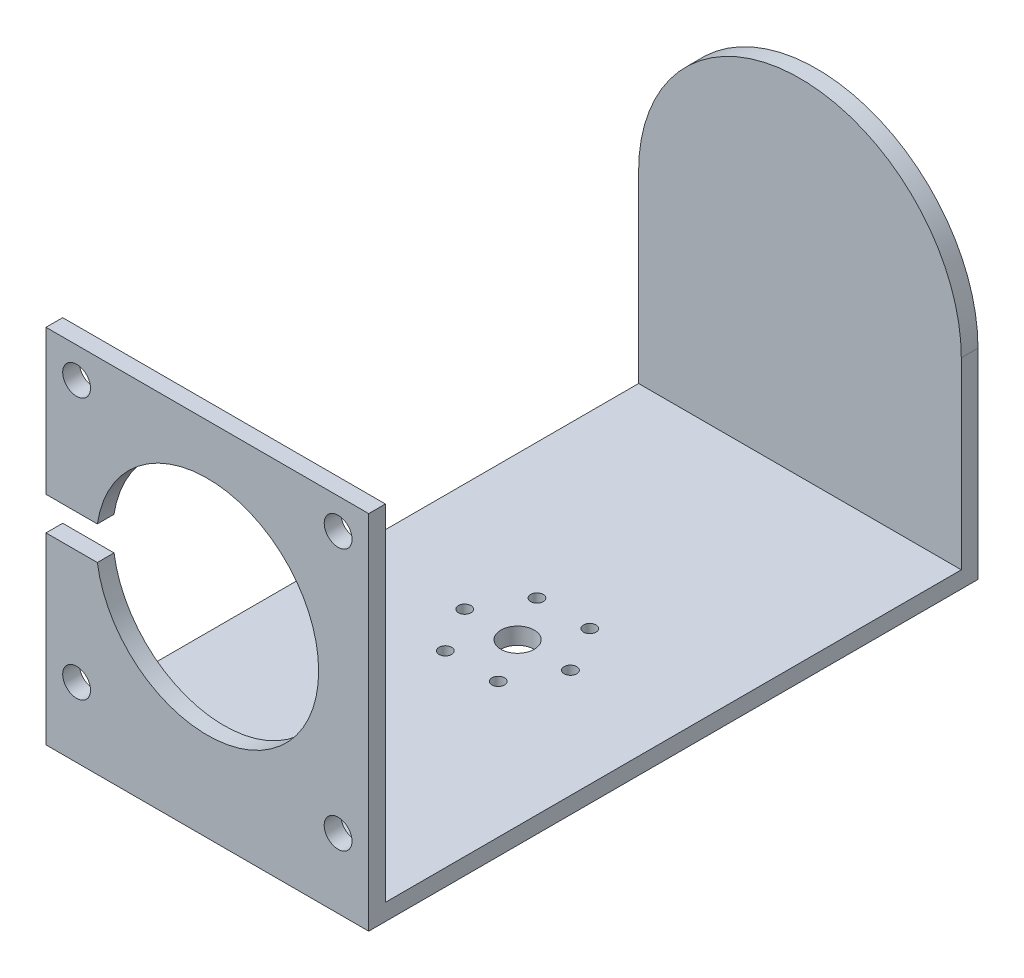
ISO-10303-21;
HEADER;
FILE_DESCRIPTION(('STEP AP214'),'2;1');
FILE_NAME('part.step','',(''),(''),'','','');
FILE_SCHEMA(('AUTOMOTIVE_DESIGN { 1 0 10303 214 1 1 1 1 }'));
ENDSEC;
DATA;
#1=APPLICATION_CONTEXT('core data for automotive mechanical design processes');
#2=APPLICATION_PROTOCOL_DEFINITION('international standard','automotive_design',2000,#1);
#3=PRODUCT_CONTEXT('',#1,'mechanical');
#4=PRODUCT('Part','Part','',(#3));
#5=PRODUCT_RELATED_PRODUCT_CATEGORY('part','',(#4));
#6=PRODUCT_DEFINITION_FORMATION('','',#4);
#7=PRODUCT_DEFINITION_CONTEXT('part definition',#1,'design');
#8=PRODUCT_DEFINITION('design','',#6,#7);
#9=PRODUCT_DEFINITION_SHAPE('','',#8);
#10=(LENGTH_UNIT() NAMED_UNIT(*) SI_UNIT(.MILLI.,.METRE.));
#11=(NAMED_UNIT(*) PLANE_ANGLE_UNIT() SI_UNIT($,.RADIAN.));
#12=(NAMED_UNIT(*) SI_UNIT($,.STERADIAN.) SOLID_ANGLE_UNIT());
#13=UNCERTAINTY_MEASURE_WITH_UNIT(LENGTH_MEASURE(1.E-05),#10,'distance_accuracy_value','');
#14=(GEOMETRIC_REPRESENTATION_CONTEXT(3) GLOBAL_UNCERTAINTY_ASSIGNED_CONTEXT((#13)) GLOBAL_UNIT_ASSIGNED_CONTEXT((#10,
#11,#12)) REPRESENTATION_CONTEXT('',''));
#15=CARTESIAN_POINT('',(0.,0.,0.));
#16=DIRECTION('',(0.,0.,1.));
#17=DIRECTION('',(1.,0.,0.));
#18=AXIS2_PLACEMENT_3D('',#15,#16,#17);
#19=CARTESIAN_POINT('',(0.,0.,0.));
#20=DIRECTION('',(-1.,0.,0.));
#21=DIRECTION('',(0.,0.,1.));
#22=AXIS2_PLACEMENT_3D('',#19,#20,#21);
#23=PLANE('',#22);
#24=DIRECTION('',(0.,0.,1.));
#25=VECTOR('',#24,1.);
#26=CARTESIAN_POINT('',(0.,-31.5991903846266,0.));
#27=LINE('',#26,#25);
#28=CARTESIAN_POINT('',(0.,-31.5991903846266,-30.1483281173427));
#29=VERTEX_POINT('',#28);
#30=CARTESIAN_POINT('',(0.,-31.5991903846266,73.3516718826573));
#31=VERTEX_POINT('',#30);
#32=EDGE_CURVE('E150',#29,#31,#27,.T.);
#33=ORIENTED_EDGE('',*,*,#32,.F.);
#34=DIRECTION('',(0.,-1.,0.));
#35=VECTOR('',#34,1.);
#36=CARTESIAN_POINT('',(0.,-29.5991903846266,-30.1483281173427));
#37=LINE('',#36,#35);
#38=CARTESIAN_POINT('',(0.,1.40080961537345,-30.1483281173427));
#39=VERTEX_POINT('',#38);
#40=EDGE_CURVE('E262',#39,#29,#37,.T.);
#41=ORIENTED_EDGE('',*,*,#40,.F.);
#42=DIRECTION('',(0.,0.,-1.));
#43=VECTOR('',#42,1.);
#44=CARTESIAN_POINT('',(0.,1.40080961537345,24.8516718826573));
#45=LINE('',#44,#43);
#46=CARTESIAN_POINT('',(0.,1.40080961537345,-33.1483281173427));
#47=VERTEX_POINT('',#46);
#48=EDGE_CURVE('E288',#47,#39,#45,.F.);
#49=ORIENTED_EDGE('',*,*,#48,.F.);
#50=DIRECTION('',(0.,1.,0.));
#51=VECTOR('',#50,1.);
#52=CARTESIAN_POINT('',(0.,30.4008096153734,-33.1483281173427));
#53=LINE('',#52,#51);
#54=CARTESIAN_POINT('',(0.,-34.5991903846266,-33.1483281173427));
#55=VERTEX_POINT('',#54);
#56=EDGE_CURVE('E259',#55,#47,#53,.T.);
#57=ORIENTED_EDGE('',*,*,#56,.F.);
#58=DIRECTION('',(0.,0.,-1.));
#59=VECTOR('',#58,1.);
#60=CARTESIAN_POINT('',(0.,-34.5991903846266,-33.1483281173427));
#61=LINE('',#60,#59);
#62=CARTESIAN_POINT('',(0.,-34.5991903846266,76.3516718826573));
#63=VERTEX_POINT('',#62);
#64=EDGE_CURVE('E257',#63,#55,#61,.T.);
#65=ORIENTED_EDGE('',*,*,#64,.F.);
#66=DIRECTION('',(0.,-1.,0.));
#67=VECTOR('',#66,1.);
#68=CARTESIAN_POINT('',(0.,-34.5991903846266,76.3516718826573));
#69=LINE('',#68,#67);
#70=CARTESIAN_POINT('',(0.,-1.59919038462657,76.3516718826573));
#71=VERTEX_POINT('',#70);
#72=EDGE_CURVE('E253',#71,#63,#69,.T.);
#73=ORIENTED_EDGE('',*,*,#72,.F.);
#74=DIRECTION('',(0.,0.,1.));
#75=VECTOR('',#74,1.);
#76=CARTESIAN_POINT('',(0.,-1.59919038462657,66.3516718826573));
#77=LINE('',#76,#75);
#78=CARTESIAN_POINT('',(0.,-1.59919038462657,73.3516718826573));
#79=VERTEX_POINT('',#78);
#80=EDGE_CURVE('E204',#79,#71,#77,.T.);
#81=ORIENTED_EDGE('',*,*,#80,.F.);
#82=DIRECTION('',(0.,1.,0.));
#83=VECTOR('',#82,1.);
#84=CARTESIAN_POINT('',(0.,30.4008096153734,73.3516718826573));
#85=LINE('',#84,#83);
#86=EDGE_CURVE('E242',#31,#79,#85,.T.);
#87=ORIENTED_EDGE('',*,*,#86,.F.);
#88=EDGE_LOOP('',(#33,#41,#49,#57,#65,#73,#81,#87));
#89=FACE_BOUND('',#88,.T.);
#90=ADVANCED_FACE('F39',(#89),#23,.T.);
#91=CARTESIAN_POINT('',(58.,30.4008096153734,-33.1483281173427));
#92=DIRECTION('',(0.,0.,1.));
#93=DIRECTION('',(0.,-1.,0.));
#94=AXIS2_PLACEMENT_3D('',#91,#92,#93);
#95=PLANE('',#94);
#96=ORIENTED_EDGE('',*,*,#56,.T.);
#97=CARTESIAN_POINT('',(29.,1.40080961537345,-33.1483281173427));
#98=DIRECTION('',(0.,0.,1.));
#99=DIRECTION('',(1.,0.,0.));
#100=AXIS2_PLACEMENT_3D('',#97,#98,#99);
#101=CIRCLE('',#100,29.);
#102=CARTESIAN_POINT('',(58.,1.40080961537345,-33.1483281173427));
#103=VERTEX_POINT('',#102);
#104=EDGE_CURVE('E215',#103,#47,#101,.T.);
#105=ORIENTED_EDGE('',*,*,#104,.F.);
#106=DIRECTION('',(0.,1.,0.));
#107=VECTOR('',#106,1.);
#108=CARTESIAN_POINT('',(58.,30.4008096153734,-33.1483281173427));
#109=LINE('',#108,#107);
#110=CARTESIAN_POINT('',(58.,-34.5991903846266,-33.1483281173427));
#111=VERTEX_POINT('',#110);
#112=EDGE_CURVE('E246',#111,#103,#109,.T.);
#113=ORIENTED_EDGE('',*,*,#112,.F.);
#114=DIRECTION('',(-1.,0.,0.));
#115=VECTOR('',#114,1.);
#116=CARTESIAN_POINT('',(58.,-34.5991903846266,-33.1483281173427));
#117=LINE('',#116,#115);
#118=EDGE_CURVE('E267',#111,#55,#117,.T.);
#119=ORIENTED_EDGE('',*,*,#118,.T.);
#120=EDGE_LOOP('',(#96,#105,#113,#119));
#121=FACE_BOUND('',#120,.T.);
#122=CARTESIAN_POINT('',(29.,1.40080961537345,-33.1483281173427));
#123=DIRECTION('',(0.,0.,1.));
#124=DIRECTION('',(0.,-1.,0.));
#125=AXIS2_PLACEMENT_3D('',#122,#123,#124);
#126=CIRCLE('',#125,2.95);
#127=CARTESIAN_POINT('',(29.,-1.54919038462655,-33.1483281173427));
#128=VERTEX_POINT('',#127);
#129=EDGE_CURVE('E291',#128,#128,#126,.F.);
#130=ORIENTED_EDGE('',*,*,#129,.F.);
#131=EDGE_LOOP('',(#130));
#132=FACE_BOUND('',#131,.T.);
#133=ADVANCED_FACE('F333',(#121,#132),#95,.F.);
#134=CARTESIAN_POINT('',(58.,30.4008096153734,76.3516718826573));
#135=DIRECTION('',(0.,-1.,0.));
#136=DIRECTION('',(0.,0.,-1.));
#137=AXIS2_PLACEMENT_3D('',#134,#135,#136);
#138=PLANE('',#137);
#139=DIRECTION('',(0.,0.,1.));
#140=VECTOR('',#139,1.);
#141=CARTESIAN_POINT('',(0.,30.4008096153734,76.3516718826573));
#142=LINE('',#141,#140);
#143=CARTESIAN_POINT('',(0.,30.4008096153734,73.3516718826573));
#144=VERTEX_POINT('',#143);
#145=CARTESIAN_POINT('',(0.,30.4008096153734,76.3516718826573));
#146=VERTEX_POINT('',#145);
#147=EDGE_CURVE('E250',#144,#146,#142,.T.);
#148=ORIENTED_EDGE('',*,*,#147,.T.);
#149=DIRECTION('',(-1.,0.,0.));
#150=VECTOR('',#149,1.);
#151=CARTESIAN_POINT('',(58.,30.4008096153734,76.3516718826573));
#152=LINE('',#151,#150);
#153=CARTESIAN_POINT('',(58.,30.4008096153734,76.3516718826573));
#154=VERTEX_POINT('',#153);
#155=EDGE_CURVE('E273',#154,#146,#152,.T.);
#156=ORIENTED_EDGE('',*,*,#155,.F.);
#157=DIRECTION('',(0.,0.,1.));
#158=VECTOR('',#157,1.);
#159=CARTESIAN_POINT('',(58.,30.4008096153734,76.3516718826573));
#160=LINE('',#159,#158);
#161=CARTESIAN_POINT('',(58.,30.4008096153734,73.3516718826573));
#162=VERTEX_POINT('',#161);
#163=EDGE_CURVE('E239',#162,#154,#160,.T.);
#164=ORIENTED_EDGE('',*,*,#163,.F.);
#165=DIRECTION('',(-1.,0.,0.));
#166=VECTOR('',#165,1.);
#167=CARTESIAN_POINT('',(58.,30.4008096153734,73.3516718826573));
#168=LINE('',#167,#166);
#169=EDGE_CURVE('E135',#162,#144,#168,.T.);
#170=ORIENTED_EDGE('',*,*,#169,.T.);
#171=EDGE_LOOP('',(#148,#156,#164,#170));
#172=FACE_BOUND('',#171,.T.);
#173=ADVANCED_FACE('F41',(#172),#138,.F.);
#174=CARTESIAN_POINT('',(58.,-34.5991903846266,76.3516718826573));
#175=DIRECTION('',(0.,0.,-1.));
#176=DIRECTION('',(0.,1.,0.));
#177=AXIS2_PLACEMENT_3D('',#174,#175,#176);
#178=PLANE('',#177);
#179=CARTESIAN_POINT('',(5.50000000000001,-22.0991903846266,76.3516718826573));
#180=DIRECTION('',(0.,0.,1.));
#181=DIRECTION('',(-1.,0.,0.));
#182=AXIS2_PLACEMENT_3D('',#179,#180,#181);
#183=CIRCLE('',#182,2.5);
#184=CARTESIAN_POINT('',(3.00000000000001,-22.0991903846266,76.3516718826573));
#185=VERTEX_POINT('',#184);
#186=EDGE_CURVE('E223',#185,#185,#183,.T.);
#187=ORIENTED_EDGE('',*,*,#186,.F.);
#188=EDGE_LOOP('',(#187));
#189=FACE_BOUND('',#188,.T.);
#190=CARTESIAN_POINT('',(52.5,-22.0991903846266,76.3516718826573));
#191=DIRECTION('',(0.,0.,1.));
#192=DIRECTION('',(1.,0.,0.));
#193=AXIS2_PLACEMENT_3D('',#190,#191,#192);
#194=CIRCLE('',#193,2.5);
#195=CARTESIAN_POINT('',(55.,-22.0991903846266,76.3516718826573));
#196=VERTEX_POINT('',#195);
#197=EDGE_CURVE('E227',#196,#196,#194,.T.);
#198=ORIENTED_EDGE('',*,*,#197,.F.);
#199=EDGE_LOOP('',(#198));
#200=FACE_BOUND('',#199,.T.);
#201=CARTESIAN_POINT('',(52.5,24.9008096153734,76.3516718826573));
#202=DIRECTION('',(0.,0.,1.));
#203=DIRECTION('',(-1.,0.,0.));
#204=AXIS2_PLACEMENT_3D('',#201,#202,#203);
#205=CIRCLE('',#204,2.5);
#206=CARTESIAN_POINT('',(50.,24.9008096153734,76.3516718826573));
#207=VERTEX_POINT('',#206);
#208=EDGE_CURVE('E231',#207,#207,#205,.T.);
#209=ORIENTED_EDGE('',*,*,#208,.F.);
#210=EDGE_LOOP('',(#209));
#211=FACE_BOUND('',#210,.T.);
#212=CARTESIAN_POINT('',(5.5,24.9008096153734,76.3516718826573));
#213=DIRECTION('',(0.,0.,1.));
#214=DIRECTION('',(1.,0.,0.));
#215=AXIS2_PLACEMENT_3D('',#212,#213,#214);
#216=CIRCLE('',#215,2.5);
#217=CARTESIAN_POINT('',(8.,24.9008096153734,76.3516718826573));
#218=VERTEX_POINT('',#217);
#219=EDGE_CURVE('E235',#218,#218,#216,.T.);
#220=ORIENTED_EDGE('',*,*,#219,.F.);
#221=EDGE_LOOP('',(#220));
#222=FACE_BOUND('',#221,.T.);
#223=CARTESIAN_POINT('',(29.,1.40080961537344,76.3516718826573));
#224=DIRECTION('',(0.,0.,1.));
#225=DIRECTION('',(1.,0.,0.));
#226=AXIS2_PLACEMENT_3D('',#223,#224,#225);
#227=CIRCLE('',#226,20.);
#228=CARTESIAN_POINT('',(9.22628006671482,-1.59919038462657,76.3516718826573));
#229=VERTEX_POINT('',#228);
#230=CARTESIAN_POINT('',(9.22628006671482,4.40080961537343,76.3516718826573));
#231=VERTEX_POINT('',#230);
#232=EDGE_CURVE('E219',#229,#231,#227,.T.);
#233=ORIENTED_EDGE('',*,*,#232,.F.);
#234=DIRECTION('',(1.,0.,0.));
#235=VECTOR('',#234,1.);
#236=CARTESIAN_POINT('',(29.,-1.59919038462656,76.3516718826573));
#237=LINE('',#236,#235);
#238=EDGE_CURVE('E63',#71,#229,#237,.T.);
#239=ORIENTED_EDGE('',*,*,#238,.F.);
#240=ORIENTED_EDGE('',*,*,#72,.T.);
#241=DIRECTION('',(-1.,0.,0.));
#242=VECTOR('',#241,1.);
#243=CARTESIAN_POINT('',(58.,-34.5991903846266,76.3516718826573));
#244=LINE('',#243,#242);
#245=CARTESIAN_POINT('',(58.,-34.5991903846266,76.3516718826573));
#246=VERTEX_POINT('',#245);
#247=EDGE_CURVE('E270',#246,#63,#244,.T.);
#248=ORIENTED_EDGE('',*,*,#247,.F.);
#249=DIRECTION('',(0.,-1.,0.));
#250=VECTOR('',#249,1.);
#251=CARTESIAN_POINT('',(58.,-34.5991903846266,76.3516718826573));
#252=LINE('',#251,#250);
#253=EDGE_CURVE('E241',#154,#246,#252,.T.);
#254=ORIENTED_EDGE('',*,*,#253,.F.);
#255=ORIENTED_EDGE('',*,*,#155,.T.);
#256=CARTESIAN_POINT('',(0.,4.40080961537343,76.3516718826573));
#257=VERTEX_POINT('',#256);
#258=EDGE_CURVE('E254',#146,#257,#69,.T.);
#259=ORIENTED_EDGE('',*,*,#258,.T.);
#260=DIRECTION('',(-1.,0.,0.));
#261=VECTOR('',#260,1.);
#262=CARTESIAN_POINT('',(29.,4.40080961537344,76.3516718826573));
#263=LINE('',#262,#261);
#264=EDGE_CURVE('E200',#231,#257,#263,.T.);
#265=ORIENTED_EDGE('',*,*,#264,.F.);
#266=EDGE_LOOP('',(#233,#239,#240,#248,#254,#255,#259,#265));
#267=FACE_BOUND('',#266,.T.);
#268=ADVANCED_FACE('F308',(#189,#200,#211,#222,#267),#178,.F.);
#269=CARTESIAN_POINT('',(58.,-34.5991903846266,-33.1483281173427));
#270=DIRECTION('',(0.,1.,0.));
#271=DIRECTION('',(0.,0.,1.));
#272=AXIS2_PLACEMENT_3D('',#269,#270,#271);
#273=PLANE('',#272);
#274=CARTESIAN_POINT('',(29.,-34.5991903846266,20.6016718826573));
#275=DIRECTION('',(0.,-1.,0.));
#276=DIRECTION('',(0.,0.,-1.));
#277=AXIS2_PLACEMENT_3D('',#274,#275,#276);
#278=CIRCLE('',#277,3.);
#279=CARTESIAN_POINT('',(29.,-34.5991903846266,17.6016718826573));
#280=VERTEX_POINT('',#279);
#281=EDGE_CURVE('E179',#280,#280,#278,.T.);
#282=ORIENTED_EDGE('',*,*,#281,.F.);
#283=EDGE_LOOP('',(#282));
#284=FACE_BOUND('',#283,.T.);
#285=CARTESIAN_POINT('',(19.5,-34.5991903846266,20.6016718826573));
#286=DIRECTION('',(0.,-1.,0.));
#287=DIRECTION('',(0.,0.,-1.));
#288=AXIS2_PLACEMENT_3D('',#285,#286,#287);
#289=CIRCLE('',#288,1.13029999999999);
#290=CARTESIAN_POINT('',(19.5,-34.5991903846266,19.4713718826573));
#291=VERTEX_POINT('',#290);
#292=EDGE_CURVE('E182',#291,#291,#289,.T.);
#293=ORIENTED_EDGE('',*,*,#292,.F.);
#294=EDGE_LOOP('',(#293));
#295=FACE_BOUND('',#294,.T.);
#296=CARTESIAN_POINT('',(24.2499999999996,-34.5991903846266,28.8289132186097));
#297=DIRECTION('',(0.,-1.,0.));
#298=DIRECTION('',(0.,0.,-1.));
#299=AXIS2_PLACEMENT_3D('',#296,#297,#298);
#300=CIRCLE('',#299,1.13029999999999);
#301=CARTESIAN_POINT('',(24.2499999999996,-34.5991903846266,27.6986132186097));
#302=VERTEX_POINT('',#301);
#303=EDGE_CURVE('E185',#302,#302,#300,.T.);
#304=ORIENTED_EDGE('',*,*,#303,.F.);
#305=EDGE_LOOP('',(#304));
#306=FACE_BOUND('',#305,.T.);
#307=CARTESIAN_POINT('',(33.7499999999996,-34.5991903846266,28.8289132186101));
#308=DIRECTION('',(0.,-1.,0.));
#309=DIRECTION('',(0.,0.,-1.));
#310=AXIS2_PLACEMENT_3D('',#307,#308,#309);
#311=CIRCLE('',#310,1.13029999999999);
#312=CARTESIAN_POINT('',(33.7499999999996,-34.5991903846266,27.6986132186101));
#313=VERTEX_POINT('',#312);
#314=EDGE_CURVE('E188',#313,#313,#311,.T.);
#315=ORIENTED_EDGE('',*,*,#314,.F.);
#316=EDGE_LOOP('',(#315));
#317=FACE_BOUND('',#316,.T.);
#318=CARTESIAN_POINT('',(38.5,-34.5991903846266,20.6016718826581));
#319=DIRECTION('',(0.,-1.,0.));
#320=DIRECTION('',(0.,0.,-1.));
#321=AXIS2_PLACEMENT_3D('',#318,#319,#320);
#322=CIRCLE('',#321,1.13029999999999);
#323=CARTESIAN_POINT('',(38.5,-34.5991903846266,19.4713718826582));
#324=VERTEX_POINT('',#323);
#325=EDGE_CURVE('E191',#324,#324,#322,.T.);
#326=ORIENTED_EDGE('',*,*,#325,.F.);
#327=EDGE_LOOP('',(#326));
#328=FACE_BOUND('',#327,.T.);
#329=CARTESIAN_POINT('',(33.7500000000003,-34.5991903846266,12.3744305467058));
#330=DIRECTION('',(0.,-1.,0.));
#331=DIRECTION('',(0.,0.,-1.));
#332=AXIS2_PLACEMENT_3D('',#329,#330,#331);
#333=CIRCLE('',#332,1.13029999999999);
#334=CARTESIAN_POINT('',(33.7500000000003,-34.5991903846266,11.2441305467058));
#335=VERTEX_POINT('',#334);
#336=EDGE_CURVE('E194',#335,#335,#333,.T.);
#337=ORIENTED_EDGE('',*,*,#336,.F.);
#338=EDGE_LOOP('',(#337));
#339=FACE_BOUND('',#338,.T.);
#340=CARTESIAN_POINT('',(24.2500000000003,-34.5991903846266,12.3744305467054));
#341=DIRECTION('',(0.,-1.,0.));
#342=DIRECTION('',(0.,0.,-1.));
#343=AXIS2_PLACEMENT_3D('',#340,#341,#342);
#344=CIRCLE('',#343,1.13029999999999);
#345=CARTESIAN_POINT('',(24.2500000000003,-34.5991903846266,11.2441305467054));
#346=VERTEX_POINT('',#345);
#347=EDGE_CURVE('E197',#346,#346,#344,.T.);
#348=ORIENTED_EDGE('',*,*,#347,.F.);
#349=EDGE_LOOP('',(#348));
#350=FACE_BOUND('',#349,.T.);
#351=ORIENTED_EDGE('',*,*,#64,.T.);
#352=ORIENTED_EDGE('',*,*,#118,.F.);
#353=DIRECTION('',(0.,0.,-1.));
#354=VECTOR('',#353,1.);
#355=CARTESIAN_POINT('',(58.,-34.5991903846266,-33.1483281173427));
#356=LINE('',#355,#354);
#357=EDGE_CURVE('E244',#246,#111,#356,.T.);
#358=ORIENTED_EDGE('',*,*,#357,.F.);
#359=ORIENTED_EDGE('',*,*,#247,.T.);
#360=EDGE_LOOP('',(#351,#352,#358,#359));
#361=FACE_BOUND('',#360,.T.);
#362=ADVANCED_FACE('F311',(#284,#295,#306,#317,#328,#339,#350,#361),#273,.F.);
#363=CARTESIAN_POINT('',(58.,-29.5991903846266,-30.1483281173427));
#364=DIRECTION('',(0.,0.,-1.));
#365=DIRECTION('',(-1.,0.,0.));
#366=AXIS2_PLACEMENT_3D('',#363,#364,#365);
#367=PLANE('',#366);
#368=CARTESIAN_POINT('',(29.,1.40080961537345,-30.1483281173427));
#369=DIRECTION('',(0.,0.,-1.));
#370=DIRECTION('',(-1.,0.,0.));
#371=AXIS2_PLACEMENT_3D('',#368,#369,#370);
#372=CIRCLE('',#371,29.);
#373=CARTESIAN_POINT('',(58.,1.40080961537345,-30.1483281173427));
#374=VERTEX_POINT('',#373);
#375=EDGE_CURVE('E217',#374,#39,#372,.F.);
#376=ORIENTED_EDGE('',*,*,#375,.T.);
#377=ORIENTED_EDGE('',*,*,#40,.T.);
#378=DIRECTION('',(1.,0.,0.));
#379=VECTOR('',#378,1.);
#380=CARTESIAN_POINT('',(-32.,-31.5991903846266,-30.1483281173427));
#381=LINE('',#380,#379);
#382=CARTESIAN_POINT('',(58.,-31.5991903846266,-30.1483281173427));
#383=VERTEX_POINT('',#382);
#384=EDGE_CURVE('E151',#29,#383,#381,.T.);
#385=ORIENTED_EDGE('',*,*,#384,.T.);
#386=DIRECTION('',(0.,-1.,0.));
#387=VECTOR('',#386,1.);
#388=CARTESIAN_POINT('',(58.,-29.5991903846266,-30.1483281173427));
#389=LINE('',#388,#387);
#390=EDGE_CURVE('E140',#374,#383,#389,.T.);
#391=ORIENTED_EDGE('',*,*,#390,.F.);
#392=EDGE_LOOP('',(#376,#377,#385,#391));
#393=FACE_BOUND('',#392,.T.);
#394=ADVANCED_FACE('F354',(#393),#367,.F.);
#395=CARTESIAN_POINT('',(58.,30.4008096153734,73.3516718826573));
#396=DIRECTION('',(0.,0.,1.));
#397=DIRECTION('',(0.,-1.,0.));
#398=AXIS2_PLACEMENT_3D('',#395,#396,#397);
#399=PLANE('',#398);
#400=ORIENTED_EDGE('',*,*,#86,.T.);
#401=DIRECTION('',(1.,0.,0.));
#402=VECTOR('',#401,1.);
#403=CARTESIAN_POINT('',(58.,-1.59919038462655,73.3516718826573));
#404=LINE('',#403,#402);
#405=CARTESIAN_POINT('',(9.22628006671482,-1.59919038462657,73.3516718826573));
#406=VERTEX_POINT('',#405);
#407=EDGE_CURVE('E209',#79,#406,#404,.T.);
#408=ORIENTED_EDGE('',*,*,#407,.T.);
#409=CARTESIAN_POINT('',(29.,1.40080961537344,73.3516718826573));
#410=DIRECTION('',(0.,0.,1.));
#411=DIRECTION('',(0.,-1.,0.));
#412=AXIS2_PLACEMENT_3D('',#409,#410,#411);
#413=CIRCLE('',#412,20.);
#414=CARTESIAN_POINT('',(9.22628006671482,4.40080961537343,73.3516718826573));
#415=VERTEX_POINT('',#414);
#416=EDGE_CURVE('E222',#406,#415,#413,.T.);
#417=ORIENTED_EDGE('',*,*,#416,.T.);
#418=DIRECTION('',(-1.,0.,0.));
#419=VECTOR('',#418,1.);
#420=CARTESIAN_POINT('',(58.,4.40080961537344,73.3516718826573));
#421=LINE('',#420,#419);
#422=CARTESIAN_POINT('',(0.,4.40080961537343,73.3516718826573));
#423=VERTEX_POINT('',#422);
#424=EDGE_CURVE('E55',#415,#423,#421,.T.);
#425=ORIENTED_EDGE('',*,*,#424,.T.);
#426=EDGE_CURVE('E264',#423,#144,#85,.T.);
#427=ORIENTED_EDGE('',*,*,#426,.T.);
#428=ORIENTED_EDGE('',*,*,#169,.F.);
#429=DIRECTION('',(0.,1.,0.));
#430=VECTOR('',#429,1.);
#431=CARTESIAN_POINT('',(58.,30.4008096153734,73.3516718826573));
#432=LINE('',#431,#430);
#433=CARTESIAN_POINT('',(58.,-31.5991903846266,73.3516718826573));
#434=VERTEX_POINT('',#433);
#435=EDGE_CURVE('E128',#434,#162,#432,.T.);
#436=ORIENTED_EDGE('',*,*,#435,.F.);
#437=DIRECTION('',(1.,0.,0.));
#438=VECTOR('',#437,1.);
#439=CARTESIAN_POINT('',(-32.,-31.5991903846266,73.3516718826573));
#440=LINE('',#439,#438);
#441=EDGE_CURVE('E133',#31,#434,#440,.T.);
#442=ORIENTED_EDGE('',*,*,#441,.F.);
#443=EDGE_LOOP('',(#400,#408,#417,#425,#427,#428,#436,#442));
#444=FACE_BOUND('',#443,.T.);
#445=CARTESIAN_POINT('',(5.50000000000001,-22.0991903846266,73.3516718826573));
#446=DIRECTION('',(0.,0.,1.));
#447=DIRECTION('',(0.,-1.,0.));
#448=AXIS2_PLACEMENT_3D('',#445,#446,#447);
#449=CIRCLE('',#448,2.5);
#450=CARTESIAN_POINT('',(5.50000000000001,-24.5991903846266,73.3516718826573));
#451=VERTEX_POINT('',#450);
#452=EDGE_CURVE('E226',#451,#451,#449,.T.);
#453=ORIENTED_EDGE('',*,*,#452,.T.);
#454=EDGE_LOOP('',(#453));
#455=FACE_BOUND('',#454,.T.);
#456=CARTESIAN_POINT('',(52.5,-22.0991903846266,73.3516718826573));
#457=DIRECTION('',(0.,0.,1.));
#458=DIRECTION('',(0.,-1.,0.));
#459=AXIS2_PLACEMENT_3D('',#456,#457,#458);
#460=CIRCLE('',#459,2.5);
#461=CARTESIAN_POINT('',(52.5,-24.5991903846266,73.3516718826573));
#462=VERTEX_POINT('',#461);
#463=EDGE_CURVE('E230',#462,#462,#460,.T.);
#464=ORIENTED_EDGE('',*,*,#463,.T.);
#465=EDGE_LOOP('',(#464));
#466=FACE_BOUND('',#465,.T.);
#467=CARTESIAN_POINT('',(52.5,24.9008096153734,73.3516718826573));
#468=DIRECTION('',(0.,0.,1.));
#469=DIRECTION('',(0.,-1.,0.));
#470=AXIS2_PLACEMENT_3D('',#467,#468,#469);
#471=CIRCLE('',#470,2.5);
#472=CARTESIAN_POINT('',(52.5,22.4008096153734,73.3516718826573));
#473=VERTEX_POINT('',#472);
#474=EDGE_CURVE('E234',#473,#473,#471,.T.);
#475=ORIENTED_EDGE('',*,*,#474,.T.);
#476=EDGE_LOOP('',(#475));
#477=FACE_BOUND('',#476,.T.);
#478=CARTESIAN_POINT('',(5.5,24.9008096153734,73.3516718826573));
#479=DIRECTION('',(0.,0.,1.));
#480=DIRECTION('',(0.,-1.,0.));
#481=AXIS2_PLACEMENT_3D('',#478,#479,#480);
#482=CIRCLE('',#481,2.5);
#483=CARTESIAN_POINT('',(5.5,22.4008096153734,73.3516718826573));
#484=VERTEX_POINT('',#483);
#485=EDGE_CURVE('E238',#484,#484,#482,.T.);
#486=ORIENTED_EDGE('',*,*,#485,.T.);
#487=EDGE_LOOP('',(#486));
#488=FACE_BOUND('',#487,.T.);
#489=ADVANCED_FACE('F131',(#444,#455,#466,#477,#488),#399,.F.);
#490=CARTESIAN_POINT('',(58.,0.,0.));
#491=DIRECTION('',(-1.,0.,0.));
#492=DIRECTION('',(0.,0.,1.));
#493=AXIS2_PLACEMENT_3D('',#490,#491,#492);
#494=PLANE('',#493);
#495=ORIENTED_EDGE('',*,*,#390,.T.);
#496=DIRECTION('',(0.,0.,-1.));
#497=VECTOR('',#496,1.);
#498=CARTESIAN_POINT('',(58.,-31.5991903846266,73.3516718826573));
#499=LINE('',#498,#497);
#500=EDGE_CURVE('E148',#434,#383,#499,.T.);
#501=ORIENTED_EDGE('',*,*,#500,.F.);
#502=ORIENTED_EDGE('',*,*,#435,.T.);
#503=ORIENTED_EDGE('',*,*,#163,.T.);
#504=ORIENTED_EDGE('',*,*,#253,.T.);
#505=ORIENTED_EDGE('',*,*,#357,.T.);
#506=ORIENTED_EDGE('',*,*,#112,.T.);
#507=DIRECTION('',(0.,0.,-1.));
#508=VECTOR('',#507,1.);
#509=CARTESIAN_POINT('',(58.,1.40080961537345,24.8516718826573));
#510=LINE('',#509,#508);
#511=EDGE_CURVE('E276',#103,#374,#510,.F.);
#512=ORIENTED_EDGE('',*,*,#511,.T.);
#513=EDGE_LOOP('',(#495,#501,#502,#503,#504,#505,#506,#512));
#514=FACE_BOUND('',#513,.T.);
#515=ADVANCED_FACE('F153',(#514),#494,.F.);
#516=DIRECTION('',(0.,0.,1.));
#517=VECTOR('',#516,1.);
#518=CARTESIAN_POINT('',(0.,4.40080961537343,66.3516718826573));
#519=LINE('',#518,#517);
#520=EDGE_CURVE('E203',#423,#257,#519,.T.);
#521=ORIENTED_EDGE('',*,*,#520,.T.);
#522=ORIENTED_EDGE('',*,*,#258,.F.);
#523=ORIENTED_EDGE('',*,*,#147,.F.);
#524=ORIENTED_EDGE('',*,*,#426,.F.);
#525=EDGE_LOOP('',(#521,#522,#523,#524));
#526=FACE_BOUND('',#525,.T.);
#527=ADVANCED_FACE('F318',(#526),#23,.T.);
#528=CARTESIAN_POINT('',(5.5,24.9008096153734,18.3516718826573));
#529=DIRECTION('',(0.,0.,1.));
#530=DIRECTION('',(1.,0.,0.));
#531=AXIS2_PLACEMENT_3D('',#528,#529,#530);
#532=CYLINDRICAL_SURFACE('',#531,2.5);
#533=ORIENTED_EDGE('',*,*,#219,.T.);
#534=EDGE_LOOP('',(#533));
#535=FACE_BOUND('',#534,.T.);
#536=ORIENTED_EDGE('',*,*,#485,.F.);
#537=EDGE_LOOP('',(#536));
#538=FACE_BOUND('',#537,.T.);
#539=ADVANCED_FACE('F343',(#535,#538),#532,.F.);
#540=CARTESIAN_POINT('',(52.5,24.9008096153734,18.3516718826573));
#541=DIRECTION('',(0.,0.,1.));
#542=DIRECTION('',(1.,0.,0.));
#543=AXIS2_PLACEMENT_3D('',#540,#541,#542);
#544=CYLINDRICAL_SURFACE('',#543,2.5);
#545=ORIENTED_EDGE('',*,*,#208,.T.);
#546=EDGE_LOOP('',(#545));
#547=FACE_BOUND('',#546,.T.);
#548=ORIENTED_EDGE('',*,*,#474,.F.);
#549=EDGE_LOOP('',(#548));
#550=FACE_BOUND('',#549,.T.);
#551=ADVANCED_FACE('F348',(#547,#550),#544,.F.);
#552=CARTESIAN_POINT('',(52.5,-22.0991903846266,18.3516718826573));
#553=DIRECTION('',(0.,0.,1.));
#554=DIRECTION('',(1.,0.,0.));
#555=AXIS2_PLACEMENT_3D('',#552,#553,#554);
#556=CYLINDRICAL_SURFACE('',#555,2.5);
#557=ORIENTED_EDGE('',*,*,#197,.T.);
#558=EDGE_LOOP('',(#557));
#559=FACE_BOUND('',#558,.T.);
#560=ORIENTED_EDGE('',*,*,#463,.F.);
#561=EDGE_LOOP('',(#560));
#562=FACE_BOUND('',#561,.T.);
#563=ADVANCED_FACE('F358',(#559,#562),#556,.F.);
#564=CARTESIAN_POINT('',(5.50000000000001,-22.0991903846266,18.3516718826573));
#565=DIRECTION('',(0.,0.,1.));
#566=DIRECTION('',(1.,0.,0.));
#567=AXIS2_PLACEMENT_3D('',#564,#565,#566);
#568=CYLINDRICAL_SURFACE('',#567,2.5);
#569=ORIENTED_EDGE('',*,*,#186,.T.);
#570=EDGE_LOOP('',(#569));
#571=FACE_BOUND('',#570,.T.);
#572=ORIENTED_EDGE('',*,*,#452,.F.);
#573=EDGE_LOOP('',(#572));
#574=FACE_BOUND('',#573,.T.);
#575=ADVANCED_FACE('F362',(#571,#574),#568,.F.);
#576=CARTESIAN_POINT('',(29.,1.40080961537344,18.3516718826573));
#577=DIRECTION('',(0.,0.,1.));
#578=DIRECTION('',(1.,0.,0.));
#579=AXIS2_PLACEMENT_3D('',#576,#577,#578);
#580=CYLINDRICAL_SURFACE('',#579,20.);
#581=ORIENTED_EDGE('',*,*,#416,.F.);
#582=DIRECTION('',(0.,0.,1.));
#583=VECTOR('',#582,1.);
#584=CARTESIAN_POINT('',(9.22628006671482,-1.59919038462657,18.3516718826573));
#585=LINE('',#584,#583);
#586=EDGE_CURVE('E11',#406,#229,#585,.T.);
#587=ORIENTED_EDGE('',*,*,#586,.T.);
#588=ORIENTED_EDGE('',*,*,#232,.T.);
#589=DIRECTION('',(0.,0.,1.));
#590=VECTOR('',#589,1.);
#591=CARTESIAN_POINT('',(9.22628006671482,4.40080961537343,18.3516718826573));
#592=LINE('',#591,#590);
#593=EDGE_CURVE('E48',#231,#415,#592,.F.);
#594=ORIENTED_EDGE('',*,*,#593,.T.);
#595=EDGE_LOOP('',(#581,#587,#588,#594));
#596=FACE_BOUND('',#595,.T.);
#597=ADVANCED_FACE('F296',(#596),#580,.F.);
#598=CARTESIAN_POINT('',(29.,1.40080961537345,24.8516718826573));
#599=DIRECTION('',(0.,0.,-1.));
#600=DIRECTION('',(-1.,0.,0.));
#601=AXIS2_PLACEMENT_3D('',#598,#599,#600);
#602=CYLINDRICAL_SURFACE('',#601,29.);
#603=ORIENTED_EDGE('',*,*,#511,.F.);
#604=ORIENTED_EDGE('',*,*,#104,.T.);
#605=ORIENTED_EDGE('',*,*,#48,.T.);
#606=ORIENTED_EDGE('',*,*,#375,.F.);
#607=EDGE_LOOP('',(#603,#604,#605,#606));
#608=FACE_BOUND('',#607,.T.);
#609=ADVANCED_FACE('F369',(#608),#602,.T.);
#610=CARTESIAN_POINT('',(29.,1.40080961537345,-41.1483281173427));
#611=DIRECTION('',(0.,0.,1.));
#612=DIRECTION('',(1.,0.,0.));
#613=AXIS2_PLACEMENT_3D('',#610,#611,#612);
#614=CYLINDRICAL_SURFACE('',#613,2.95);
#615=CARTESIAN_POINT('',(29.,1.40080961537345,-41.1483281173427));
#616=DIRECTION('',(0.,0.,-1.));
#617=DIRECTION('',(-1.,0.,0.));
#618=AXIS2_PLACEMENT_3D('',#615,#616,#617);
#619=CIRCLE('',#618,2.95);
#620=CARTESIAN_POINT('',(26.05,1.40080961537345,-41.1483281173427));
#621=VERTEX_POINT('',#620);
#622=EDGE_CURVE('E212',#621,#621,#619,.T.);
#623=ORIENTED_EDGE('',*,*,#622,.F.);
#624=EDGE_LOOP('',(#623));
#625=FACE_BOUND('',#624,.T.);
#626=ORIENTED_EDGE('',*,*,#129,.T.);
#627=EDGE_LOOP('',(#626));
#628=FACE_BOUND('',#627,.T.);
#629=ADVANCED_FACE('F329',(#625,#628),#614,.T.);
#630=CARTESIAN_POINT('',(29.,1.40080961537345,-41.1483281173427));
#631=DIRECTION('',(0.,0.,-1.));
#632=DIRECTION('',(-1.,0.,0.));
#633=AXIS2_PLACEMENT_3D('',#630,#631,#632);
#634=PLANE('',#633);
#635=ORIENTED_EDGE('',*,*,#622,.T.);
#636=EDGE_LOOP('',(#635));
#637=FACE_BOUND('',#636,.T.);
#638=ADVANCED_FACE('F321',(#637),#634,.T.);
#639=CARTESIAN_POINT('',(29.,4.40080961537344,66.3516718826573));
#640=DIRECTION('',(0.,1.,0.));
#641=DIRECTION('',(-1.,0.,0.));
#642=AXIS2_PLACEMENT_3D('',#639,#640,#641);
#643=PLANE('',#642);
#644=ORIENTED_EDGE('',*,*,#593,.F.);
#645=ORIENTED_EDGE('',*,*,#264,.T.);
#646=ORIENTED_EDGE('',*,*,#520,.F.);
#647=ORIENTED_EDGE('',*,*,#424,.F.);
#648=EDGE_LOOP('',(#644,#645,#646,#647));
#649=FACE_BOUND('',#648,.T.);
#650=ADVANCED_FACE('F319',(#649),#643,.F.);
#651=CARTESIAN_POINT('',(29.,-1.59919038462656,66.3516718826573));
#652=DIRECTION('',(0.,-1.,0.));
#653=DIRECTION('',(1.,0.,0.));
#654=AXIS2_PLACEMENT_3D('',#651,#652,#653);
#655=PLANE('',#654);
#656=ORIENTED_EDGE('',*,*,#80,.T.);
#657=ORIENTED_EDGE('',*,*,#238,.T.);
#658=ORIENTED_EDGE('',*,*,#586,.F.);
#659=ORIENTED_EDGE('',*,*,#407,.F.);
#660=EDGE_LOOP('',(#656,#657,#658,#659));
#661=FACE_BOUND('',#660,.T.);
#662=ADVANCED_FACE('F301',(#661),#655,.F.);
#663=CARTESIAN_POINT('',(24.2500000000003,-34.5991903846266,12.3744305467054));
#664=DIRECTION('',(0.,-1.,0.));
#665=DIRECTION('',(0.,0.,-1.));
#666=AXIS2_PLACEMENT_3D('',#663,#664,#665);
#667=CYLINDRICAL_SURFACE('',#666,1.13029999999999);
#668=CARTESIAN_POINT('',(24.2500000000003,-31.5991903846266,12.3744305467054));
#669=DIRECTION('',(0.,-1.,0.));
#670=DIRECTION('',(0.,0.,-1.));
#671=AXIS2_PLACEMENT_3D('',#668,#669,#670);
#672=CIRCLE('',#671,1.13029999999999);
#673=CARTESIAN_POINT('',(24.2500000000003,-31.5991903846266,11.2441305467054));
#674=VERTEX_POINT('',#673);
#675=EDGE_CURVE('E175',#674,#674,#672,.F.);
#676=ORIENTED_EDGE('',*,*,#675,.T.);
#677=EDGE_LOOP('',(#676));
#678=FACE_BOUND('',#677,.T.);
#679=ORIENTED_EDGE('',*,*,#347,.T.);
#680=EDGE_LOOP('',(#679));
#681=FACE_BOUND('',#680,.T.);
#682=ADVANCED_FACE('F327',(#678,#681),#667,.F.);
#683=CARTESIAN_POINT('',(33.7500000000003,-34.5991903846266,12.3744305467058));
#684=DIRECTION('',(0.,-1.,0.));
#685=DIRECTION('',(0.,0.,-1.));
#686=AXIS2_PLACEMENT_3D('',#683,#684,#685);
#687=CYLINDRICAL_SURFACE('',#686,1.13029999999999);
#688=CARTESIAN_POINT('',(33.7500000000003,-31.5991903846266,12.3744305467058));
#689=DIRECTION('',(0.,-1.,0.));
#690=DIRECTION('',(0.,0.,-1.));
#691=AXIS2_PLACEMENT_3D('',#688,#689,#690);
#692=CIRCLE('',#691,1.13029999999999);
#693=CARTESIAN_POINT('',(33.7500000000003,-31.5991903846266,11.2441305467058));
#694=VERTEX_POINT('',#693);
#695=EDGE_CURVE('E172',#694,#694,#692,.F.);
#696=ORIENTED_EDGE('',*,*,#695,.T.);
#697=EDGE_LOOP('',(#696));
#698=FACE_BOUND('',#697,.T.);
#699=ORIENTED_EDGE('',*,*,#336,.T.);
#700=EDGE_LOOP('',(#699));
#701=FACE_BOUND('',#700,.T.);
#702=ADVANCED_FACE('F467',(#698,#701),#687,.F.);
#703=CARTESIAN_POINT('',(38.5,-34.5991903846266,20.6016718826581));
#704=DIRECTION('',(0.,-1.,0.));
#705=DIRECTION('',(0.,0.,-1.));
#706=AXIS2_PLACEMENT_3D('',#703,#704,#705);
#707=CYLINDRICAL_SURFACE('',#706,1.13029999999999);
#708=CARTESIAN_POINT('',(38.5,-31.5991903846266,20.6016718826581));
#709=DIRECTION('',(0.,-1.,0.));
#710=DIRECTION('',(0.,0.,-1.));
#711=AXIS2_PLACEMENT_3D('',#708,#709,#710);
#712=CIRCLE('',#711,1.13029999999999);
#713=CARTESIAN_POINT('',(38.5,-31.5991903846266,19.4713718826582));
#714=VERTEX_POINT('',#713);
#715=EDGE_CURVE('E169',#714,#714,#712,.F.);
#716=ORIENTED_EDGE('',*,*,#715,.T.);
#717=EDGE_LOOP('',(#716));
#718=FACE_BOUND('',#717,.T.);
#719=ORIENTED_EDGE('',*,*,#325,.T.);
#720=EDGE_LOOP('',(#719));
#721=FACE_BOUND('',#720,.T.);
#722=ADVANCED_FACE('F478',(#718,#721),#707,.F.);
#723=CARTESIAN_POINT('',(33.7499999999996,-34.5991903846266,28.8289132186101));
#724=DIRECTION('',(0.,-1.,0.));
#725=DIRECTION('',(0.,0.,-1.));
#726=AXIS2_PLACEMENT_3D('',#723,#724,#725);
#727=CYLINDRICAL_SURFACE('',#726,1.13029999999999);
#728=CARTESIAN_POINT('',(33.7499999999996,-31.5991903846266,28.8289132186101));
#729=DIRECTION('',(0.,-1.,0.));
#730=DIRECTION('',(0.,0.,-1.));
#731=AXIS2_PLACEMENT_3D('',#728,#729,#730);
#732=CIRCLE('',#731,1.13029999999999);
#733=CARTESIAN_POINT('',(33.7499999999996,-31.5991903846266,27.6986132186101));
#734=VERTEX_POINT('',#733);
#735=EDGE_CURVE('E166',#734,#734,#732,.F.);
#736=ORIENTED_EDGE('',*,*,#735,.T.);
#737=EDGE_LOOP('',(#736));
#738=FACE_BOUND('',#737,.T.);
#739=ORIENTED_EDGE('',*,*,#314,.T.);
#740=EDGE_LOOP('',(#739));
#741=FACE_BOUND('',#740,.T.);
#742=ADVANCED_FACE('F489',(#738,#741),#727,.F.);
#743=CARTESIAN_POINT('',(24.2499999999996,-34.5991903846266,28.8289132186097));
#744=DIRECTION('',(0.,-1.,0.));
#745=DIRECTION('',(0.,0.,-1.));
#746=AXIS2_PLACEMENT_3D('',#743,#744,#745);
#747=CYLINDRICAL_SURFACE('',#746,1.13029999999999);
#748=CARTESIAN_POINT('',(24.2499999999996,-31.5991903846266,28.8289132186097));
#749=DIRECTION('',(0.,-1.,0.));
#750=DIRECTION('',(0.,0.,-1.));
#751=AXIS2_PLACEMENT_3D('',#748,#749,#750);
#752=CIRCLE('',#751,1.13029999999999);
#753=CARTESIAN_POINT('',(24.2499999999996,-31.5991903846266,27.6986132186097));
#754=VERTEX_POINT('',#753);
#755=EDGE_CURVE('E163',#754,#754,#752,.F.);
#756=ORIENTED_EDGE('',*,*,#755,.T.);
#757=EDGE_LOOP('',(#756));
#758=FACE_BOUND('',#757,.T.);
#759=ORIENTED_EDGE('',*,*,#303,.T.);
#760=EDGE_LOOP('',(#759));
#761=FACE_BOUND('',#760,.T.);
#762=ADVANCED_FACE('F500',(#758,#761),#747,.F.);
#763=CARTESIAN_POINT('',(19.5,-34.5991903846266,20.6016718826573));
#764=DIRECTION('',(0.,-1.,0.));
#765=DIRECTION('',(0.,0.,-1.));
#766=AXIS2_PLACEMENT_3D('',#763,#764,#765);
#767=CYLINDRICAL_SURFACE('',#766,1.13029999999999);
#768=CARTESIAN_POINT('',(19.5,-31.5991903846266,20.6016718826573));
#769=DIRECTION('',(0.,-1.,0.));
#770=DIRECTION('',(0.,0.,-1.));
#771=AXIS2_PLACEMENT_3D('',#768,#769,#770);
#772=CIRCLE('',#771,1.13029999999999);
#773=CARTESIAN_POINT('',(19.5,-31.5991903846266,19.4713718826573));
#774=VERTEX_POINT('',#773);
#775=EDGE_CURVE('E160',#774,#774,#772,.F.);
#776=ORIENTED_EDGE('',*,*,#775,.T.);
#777=EDGE_LOOP('',(#776));
#778=FACE_BOUND('',#777,.T.);
#779=ORIENTED_EDGE('',*,*,#292,.T.);
#780=EDGE_LOOP('',(#779));
#781=FACE_BOUND('',#780,.T.);
#782=ADVANCED_FACE('F511',(#778,#781),#767,.F.);
#783=CARTESIAN_POINT('',(29.,-24.5991903846266,20.6016718826573));
#784=DIRECTION('',(0.,-1.,0.));
#785=DIRECTION('',(0.,0.,-1.));
#786=AXIS2_PLACEMENT_3D('',#783,#784,#785);
#787=CYLINDRICAL_SURFACE('',#786,3.);
#788=CARTESIAN_POINT('',(29.,-31.5991903846266,20.6016718826573));
#789=DIRECTION('',(0.,-1.,0.));
#790=DIRECTION('',(0.,0.,-1.));
#791=AXIS2_PLACEMENT_3D('',#788,#789,#790);
#792=CIRCLE('',#791,3.);
#793=CARTESIAN_POINT('',(29.,-31.5991903846266,17.6016718826573));
#794=VERTEX_POINT('',#793);
#795=EDGE_CURVE('E43',#794,#794,#792,.F.);
#796=ORIENTED_EDGE('',*,*,#795,.T.);
#797=EDGE_LOOP('',(#796));
#798=FACE_BOUND('',#797,.T.);
#799=ORIENTED_EDGE('',*,*,#281,.T.);
#800=EDGE_LOOP('',(#799));
#801=FACE_BOUND('',#800,.T.);
#802=ADVANCED_FACE('F522',(#798,#801),#787,.F.);
#803=CARTESIAN_POINT('',(-32.,-31.5991903846266,73.3516718826573));
#804=DIRECTION('',(0.,-1.,0.));
#805=DIRECTION('',(0.,0.,-1.));
#806=AXIS2_PLACEMENT_3D('',#803,#804,#805);
#807=PLANE('',#806);
#808=ORIENTED_EDGE('',*,*,#32,.T.);
#809=ORIENTED_EDGE('',*,*,#441,.T.);
#810=ORIENTED_EDGE('',*,*,#500,.T.);
#811=ORIENTED_EDGE('',*,*,#384,.F.);
#812=EDGE_LOOP('',(#808,#809,#810,#811));
#813=FACE_BOUND('',#812,.T.);
#814=ORIENTED_EDGE('',*,*,#695,.F.);
#815=EDGE_LOOP('',(#814));
#816=FACE_BOUND('',#815,.T.);
#817=ORIENTED_EDGE('',*,*,#735,.F.);
#818=EDGE_LOOP('',(#817));
#819=FACE_BOUND('',#818,.T.);
#820=ORIENTED_EDGE('',*,*,#775,.F.);
#821=EDGE_LOOP('',(#820));
#822=FACE_BOUND('',#821,.T.);
#823=ORIENTED_EDGE('',*,*,#795,.F.);
#824=EDGE_LOOP('',(#823));
#825=FACE_BOUND('',#824,.T.);
#826=ORIENTED_EDGE('',*,*,#755,.F.);
#827=EDGE_LOOP('',(#826));
#828=FACE_BOUND('',#827,.T.);
#829=ORIENTED_EDGE('',*,*,#715,.F.);
#830=EDGE_LOOP('',(#829));
#831=FACE_BOUND('',#830,.T.);
#832=ORIENTED_EDGE('',*,*,#675,.F.);
#833=EDGE_LOOP('',(#832));
#834=FACE_BOUND('',#833,.T.);
#835=ADVANCED_FACE('F145',(#813,#816,#819,#822,#825,#828,#831,#834),#807,.F.);
#836=CLOSED_SHELL('',(#90,#133,#173,#268,#362,#394,#489,#515,#527,#539,#551,#563,#575,#597,#609,
#629,#638,#650,#662,#682,#702,#722,#742,#762,#782,#802,#835));
#837=MANIFOLD_SOLID_BREP('B2',#836);
#838=ADVANCED_BREP_SHAPE_REPRESENTATION('',(#18,#837),#14);
#839=SHAPE_DEFINITION_REPRESENTATION(#9,#838);
ENDSEC;
END-ISO-10303-21;
